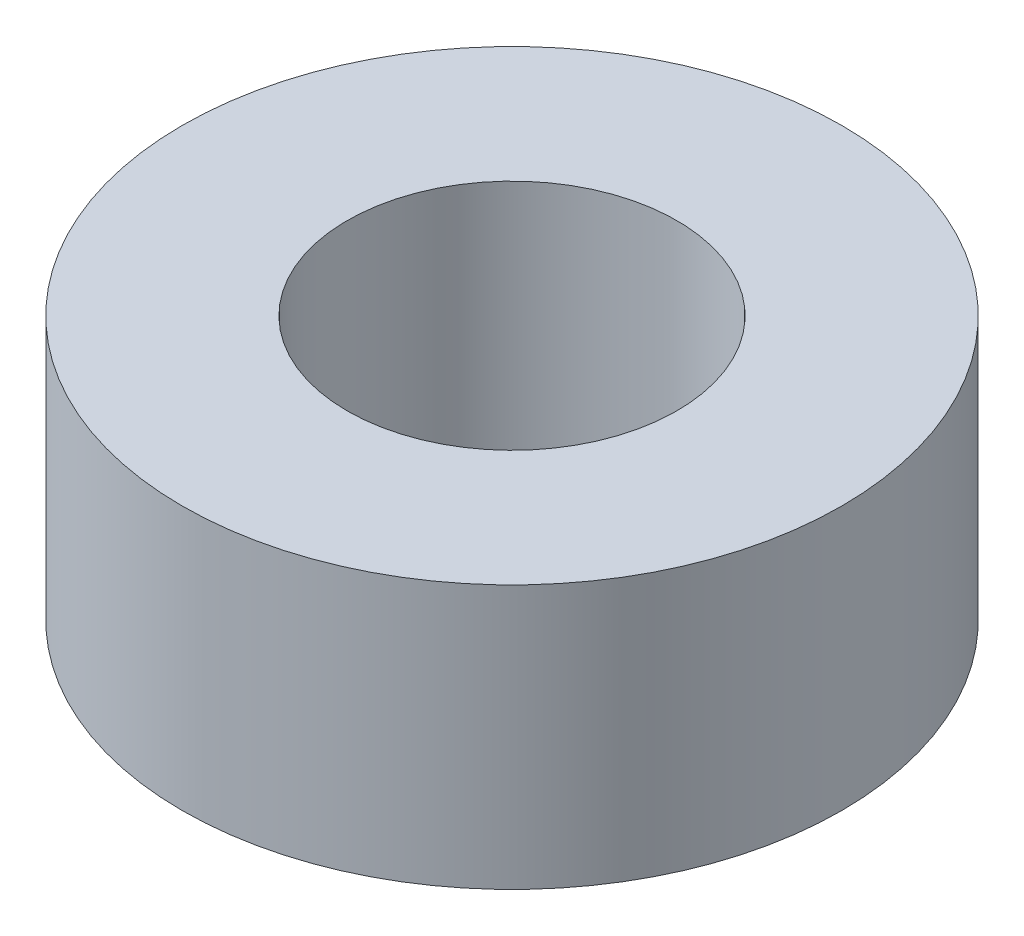
ISO-10303-21;
HEADER;
FILE_DESCRIPTION(('STEP AP214'),'2;1');
FILE_NAME('part.step','',(''),(''),'','','');
FILE_SCHEMA(('AUTOMOTIVE_DESIGN { 1 0 10303 214 1 1 1 1 }'));
ENDSEC;
DATA;
#1=APPLICATION_CONTEXT('core data for automotive mechanical design processes');
#2=APPLICATION_PROTOCOL_DEFINITION('international standard','automotive_design',2000,#1);
#3=PRODUCT_CONTEXT('',#1,'mechanical');
#4=PRODUCT('Part','Part','',(#3));
#5=PRODUCT_RELATED_PRODUCT_CATEGORY('part','',(#4));
#6=PRODUCT_DEFINITION_FORMATION('','',#4);
#7=PRODUCT_DEFINITION_CONTEXT('part definition',#1,'design');
#8=PRODUCT_DEFINITION('design','',#6,#7);
#9=PRODUCT_DEFINITION_SHAPE('','',#8);
#10=(LENGTH_UNIT() NAMED_UNIT(*) SI_UNIT(.MILLI.,.METRE.));
#11=(NAMED_UNIT(*) PLANE_ANGLE_UNIT() SI_UNIT($,.RADIAN.));
#12=(NAMED_UNIT(*) SI_UNIT($,.STERADIAN.) SOLID_ANGLE_UNIT());
#13=UNCERTAINTY_MEASURE_WITH_UNIT(LENGTH_MEASURE(1.E-05),#10,'distance_accuracy_value','');
#14=(GEOMETRIC_REPRESENTATION_CONTEXT(3) GLOBAL_UNCERTAINTY_ASSIGNED_CONTEXT((#13)) GLOBAL_UNIT_ASSIGNED_CONTEXT((#10,
#11,#12)) REPRESENTATION_CONTEXT('',''));
#15=CARTESIAN_POINT('',(0.,0.,0.));
#16=DIRECTION('',(0.,0.,1.));
#17=DIRECTION('',(1.,0.,0.));
#18=AXIS2_PLACEMENT_3D('',#15,#16,#17);
#19=CARTESIAN_POINT('',(0.,2.,0.));
#20=DIRECTION('',(0.,1.,0.));
#21=DIRECTION('',(0.,0.,1.));
#22=AXIS2_PLACEMENT_3D('',#19,#20,#21);
#23=PLANE('',#22);
#24=CARTESIAN_POINT('',(0.,2.,0.));
#25=DIRECTION('',(0.,1.,0.));
#26=DIRECTION('',(0.,0.,1.));
#27=AXIS2_PLACEMENT_3D('',#24,#25,#26);
#28=CIRCLE('',#27,5.);
#29=CARTESIAN_POINT('',(0.,2.,5.));
#30=VERTEX_POINT('',#29);
#31=EDGE_CURVE('E10',#30,#30,#28,.T.);
#32=ORIENTED_EDGE('',*,*,#31,.T.);
#33=EDGE_LOOP('',(#32));
#34=FACE_BOUND('',#33,.T.);
#35=CARTESIAN_POINT('',(0.,2.,0.));
#36=DIRECTION('',(0.,1.,0.));
#37=DIRECTION('',(0.,0.,1.));
#38=AXIS2_PLACEMENT_3D('',#35,#36,#37);
#39=CIRCLE('',#38,2.5);
#40=CARTESIAN_POINT('',(0.,2.,2.5));
#41=VERTEX_POINT('',#40);
#42=EDGE_CURVE('E49',#41,#41,#39,.T.);
#43=ORIENTED_EDGE('',*,*,#42,.F.);
#44=EDGE_LOOP('',(#43));
#45=FACE_BOUND('',#44,.T.);
#46=ADVANCED_FACE('F34',(#34,#45),#23,.T.);
#47=CARTESIAN_POINT('',(0.,-2.,0.));
#48=DIRECTION('',(0.,1.,0.));
#49=DIRECTION('',(0.,0.,1.));
#50=AXIS2_PLACEMENT_3D('',#47,#48,#49);
#51=PLANE('',#50);
#52=CARTESIAN_POINT('',(0.,-2.,0.));
#53=DIRECTION('',(0.,1.,0.));
#54=DIRECTION('',(0.,0.,1.));
#55=AXIS2_PLACEMENT_3D('',#52,#53,#54);
#56=CIRCLE('',#55,5.);
#57=CARTESIAN_POINT('',(0.,-2.,5.));
#58=VERTEX_POINT('',#57);
#59=EDGE_CURVE('E38',#58,#58,#56,.T.);
#60=ORIENTED_EDGE('',*,*,#59,.F.);
#61=EDGE_LOOP('',(#60));
#62=FACE_BOUND('',#61,.T.);
#63=CARTESIAN_POINT('',(0.,-2.,0.));
#64=DIRECTION('',(0.,1.,0.));
#65=DIRECTION('',(0.,0.,1.));
#66=AXIS2_PLACEMENT_3D('',#63,#64,#65);
#67=CIRCLE('',#66,2.5);
#68=CARTESIAN_POINT('',(0.,-2.,2.5));
#69=VERTEX_POINT('',#68);
#70=EDGE_CURVE('E51',#69,#69,#67,.T.);
#71=ORIENTED_EDGE('',*,*,#70,.T.);
#72=EDGE_LOOP('',(#71));
#73=FACE_BOUND('',#72,.T.);
#74=ADVANCED_FACE('F61',(#62,#73),#51,.F.);
#75=CARTESIAN_POINT('',(0.,2.,0.));
#76=DIRECTION('',(0.,-1.,0.));
#77=DIRECTION('',(0.,0.,-1.));
#78=AXIS2_PLACEMENT_3D('',#75,#76,#77);
#79=CYLINDRICAL_SURFACE('',#78,5.);
#80=ORIENTED_EDGE('',*,*,#31,.F.);
#81=EDGE_LOOP('',(#80));
#82=FACE_BOUND('',#81,.T.);
#83=ORIENTED_EDGE('',*,*,#59,.T.);
#84=EDGE_LOOP('',(#83));
#85=FACE_BOUND('',#84,.T.);
#86=ADVANCED_FACE('F36',(#82,#85),#79,.T.);
#87=CARTESIAN_POINT('',(0.,2.,0.));
#88=DIRECTION('',(0.,-1.,0.));
#89=DIRECTION('',(0.,0.,-1.));
#90=AXIS2_PLACEMENT_3D('',#87,#88,#89);
#91=CYLINDRICAL_SURFACE('',#90,2.5);
#92=ORIENTED_EDGE('',*,*,#42,.T.);
#93=EDGE_LOOP('',(#92));
#94=FACE_BOUND('',#93,.T.);
#95=ORIENTED_EDGE('',*,*,#70,.F.);
#96=EDGE_LOOP('',(#95));
#97=FACE_BOUND('',#96,.T.);
#98=ADVANCED_FACE('F57',(#94,#97),#91,.F.);
#99=CLOSED_SHELL('',(#46,#74,#86,#98));
#100=MANIFOLD_SOLID_BREP('B2',#99);
#101=ADVANCED_BREP_SHAPE_REPRESENTATION('',(#18,#100),#14);
#102=SHAPE_DEFINITION_REPRESENTATION(#9,#101);
ENDSEC;
END-ISO-10303-21;
